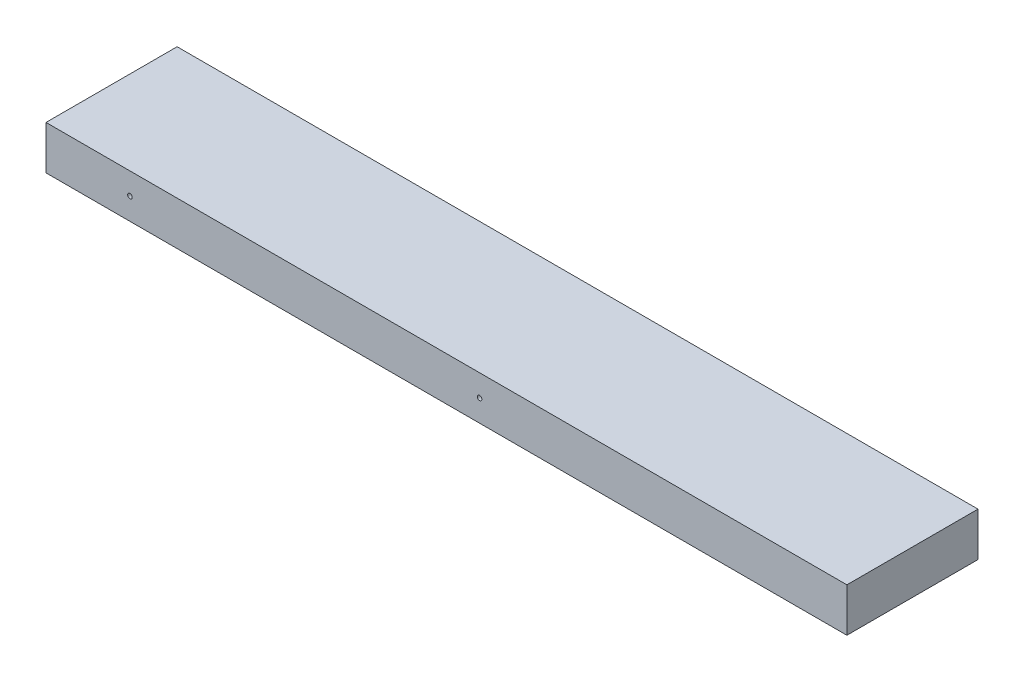
ISO-10303-21;
HEADER;
FILE_DESCRIPTION(('STEP AP214'),'2;1');
FILE_NAME('part.step','',(''),(''),'','','');
FILE_SCHEMA(('AUTOMOTIVE_DESIGN { 1 0 10303 214 1 1 1 1 }'));
ENDSEC;
DATA;
#1=APPLICATION_CONTEXT('core data for automotive mechanical design processes');
#2=APPLICATION_PROTOCOL_DEFINITION('international standard','automotive_design',2000,#1);
#3=PRODUCT_CONTEXT('',#1,'mechanical');
#4=PRODUCT('Part','Part','',(#3));
#5=PRODUCT_RELATED_PRODUCT_CATEGORY('part','',(#4));
#6=PRODUCT_DEFINITION_FORMATION('','',#4);
#7=PRODUCT_DEFINITION_CONTEXT('part definition',#1,'design');
#8=PRODUCT_DEFINITION('design','',#6,#7);
#9=PRODUCT_DEFINITION_SHAPE('','',#8);
#10=(LENGTH_UNIT() NAMED_UNIT(*) SI_UNIT(.MILLI.,.METRE.));
#11=(NAMED_UNIT(*) PLANE_ANGLE_UNIT() SI_UNIT($,.RADIAN.));
#12=(NAMED_UNIT(*) SI_UNIT($,.STERADIAN.) SOLID_ANGLE_UNIT());
#13=UNCERTAINTY_MEASURE_WITH_UNIT(LENGTH_MEASURE(1.E-05),#10,'distance_accuracy_value','');
#14=(GEOMETRIC_REPRESENTATION_CONTEXT(3) GLOBAL_UNCERTAINTY_ASSIGNED_CONTEXT((#13)) GLOBAL_UNIT_ASSIGNED_CONTEXT((#10,
#11,#12)) REPRESENTATION_CONTEXT('',''));
#15=CARTESIAN_POINT('',(0.,0.,0.));
#16=DIRECTION('',(0.,0.,1.));
#17=DIRECTION('',(1.,0.,0.));
#18=AXIS2_PLACEMENT_3D('',#15,#16,#17);
#19=CARTESIAN_POINT('',(86.360000000001,5213.35,2683.51));
#20=DIRECTION('',(0.,-1.,0.));
#21=DIRECTION('',(0.,0.,-1.));
#22=AXIS2_PLACEMENT_3D('',#19,#20,#21);
#23=PLANE('',#22);
#24=DIRECTION('',(0.,0.,-1.));
#25=VECTOR('',#24,1.);
#26=CARTESIAN_POINT('',(96.1779514960074,5213.35,2740.66));
#27=LINE('',#26,#25);
#28=CARTESIAN_POINT('',(96.1779514960074,5213.35,2740.66));
#29=VERTEX_POINT('',#28);
#30=CARTESIAN_POINT('',(96.1779514960074,5213.35,2683.51));
#31=VERTEX_POINT('',#30);
#32=EDGE_CURVE('E104',#29,#31,#27,.T.);
#33=ORIENTED_EDGE('',*,*,#32,.T.);
#34=DIRECTION('',(1.,0.,0.));
#35=VECTOR('',#34,1.);
#36=CARTESIAN_POINT('',(265.815570864873,5213.35,2683.51));
#37=LINE('',#36,#35);
#38=CARTESIAN_POINT('',(445.271141729744,5213.35000000001,2683.51));
#39=VERTEX_POINT('',#38);
#40=EDGE_CURVE('E158',#31,#39,#37,.T.);
#41=ORIENTED_EDGE('',*,*,#40,.T.);
#42=DIRECTION('',(0.,0.,-1.));
#43=VECTOR('',#42,1.);
#44=CARTESIAN_POINT('',(445.271141729744,5213.35000000001,2683.51));
#45=LINE('',#44,#43);
#46=CARTESIAN_POINT('',(445.271141729743,5213.35000000001,2740.66));
#47=VERTEX_POINT('',#46);
#48=EDGE_CURVE('E117',#47,#39,#45,.T.);
#49=ORIENTED_EDGE('',*,*,#48,.F.);
#50=DIRECTION('',(-1.,0.,0.));
#51=VECTOR('',#50,1.);
#52=CARTESIAN_POINT('',(265.815570864873,5213.35000000001,2740.66));
#53=LINE('',#52,#51);
#54=EDGE_CURVE('E80',#47,#29,#53,.T.);
#55=ORIENTED_EDGE('',*,*,#54,.T.);
#56=EDGE_LOOP('',(#33,#41,#49,#55));
#57=FACE_BOUND('',#56,.T.);
#58=ADVANCED_FACE('F40',(#57),#23,.T.);
#59=CARTESIAN_POINT('',(265.815570864873,5222.87500000001,2740.66));
#60=DIRECTION('',(0.,0.,-1.));
#61=DIRECTION('',(-1.,0.,0.));
#62=AXIS2_PLACEMENT_3D('',#59,#60,#61);
#63=PLANE('',#62);
#64=CARTESIAN_POINT('',(132.77322279899,5222.87500000001,2740.66));
#65=DIRECTION('',(0.,0.,-1.));
#66=DIRECTION('',(-1.,0.,0.));
#67=AXIS2_PLACEMENT_3D('',#64,#65,#66);
#68=CIRCLE('',#67,0.991870000000006);
#69=CARTESIAN_POINT('',(131.78135279899,5222.87500000001,2740.66));
#70=VERTEX_POINT('',#69);
#71=EDGE_CURVE('E43',#70,#70,#68,.T.);
#72=ORIENTED_EDGE('',*,*,#71,.T.);
#73=EDGE_LOOP('',(#72));
#74=FACE_BOUND('',#73,.T.);
#75=CARTESIAN_POINT('',(285.17322279899,5222.87500000001,2740.66));
#76=DIRECTION('',(0.,0.,-1.));
#77=DIRECTION('',(-1.,0.,0.));
#78=AXIS2_PLACEMENT_3D('',#75,#76,#77);
#79=CIRCLE('',#78,0.991870000000006);
#80=CARTESIAN_POINT('',(284.18135279899,5222.87500000001,2740.66));
#81=VERTEX_POINT('',#80);
#82=EDGE_CURVE('E135',#81,#81,#79,.T.);
#83=ORIENTED_EDGE('',*,*,#82,.T.);
#84=EDGE_LOOP('',(#83));
#85=FACE_BOUND('',#84,.T.);
#86=DIRECTION('',(1.,0.,0.));
#87=VECTOR('',#86,1.);
#88=CARTESIAN_POINT('',(445.271141729744,5232.4,2740.66));
#89=LINE('',#88,#87);
#90=CARTESIAN_POINT('',(96.177951496007,5232.40000000001,2740.66));
#91=VERTEX_POINT('',#90);
#92=CARTESIAN_POINT('',(445.271141729743,5232.40000000001,2740.66));
#93=VERTEX_POINT('',#92);
#94=EDGE_CURVE('E115',#91,#93,#89,.T.);
#95=ORIENTED_EDGE('',*,*,#94,.F.);
#96=DIRECTION('',(0.,-1.,0.));
#97=VECTOR('',#96,1.);
#98=CARTESIAN_POINT('',(96.1779514960074,5213.35,2740.66));
#99=LINE('',#98,#97);
#100=EDGE_CURVE('E56',#91,#29,#99,.T.);
#101=ORIENTED_EDGE('',*,*,#100,.T.);
#102=ORIENTED_EDGE('',*,*,#54,.F.);
#103=DIRECTION('',(0.,1.,0.));
#104=VECTOR('',#103,1.);
#105=CARTESIAN_POINT('',(445.271141729744,5213.35000000001,2740.66));
#106=LINE('',#105,#104);
#107=EDGE_CURVE('E119',#93,#47,#106,.F.);
#108=ORIENTED_EDGE('',*,*,#107,.F.);
#109=EDGE_LOOP('',(#95,#101,#102,#108));
#110=FACE_BOUND('',#109,.T.);
#111=ADVANCED_FACE('F114',(#74,#85,#110),#63,.F.);
#112=CARTESIAN_POINT('',(445.271141729744,5213.35000000001,2683.51));
#113=DIRECTION('',(1.,0.,0.));
#114=DIRECTION('',(0.,0.,-1.));
#115=AXIS2_PLACEMENT_3D('',#112,#113,#114);
#116=PLANE('',#115);
#117=DIRECTION('',(0.,1.,0.));
#118=VECTOR('',#117,1.);
#119=CARTESIAN_POINT('',(445.271141729743,5222.87500000001,2683.51));
#120=LINE('',#119,#118);
#121=CARTESIAN_POINT('',(445.271141729745,5232.40000000001,2683.51));
#122=VERTEX_POINT('',#121);
#123=EDGE_CURVE('E65',#39,#122,#120,.T.);
#124=ORIENTED_EDGE('',*,*,#123,.T.);
#125=DIRECTION('',(0.,0.,1.));
#126=VECTOR('',#125,1.);
#127=CARTESIAN_POINT('',(445.271141729745,5232.40000000001,2683.51));
#128=LINE('',#127,#126);
#129=EDGE_CURVE('E48',#93,#122,#128,.F.);
#130=ORIENTED_EDGE('',*,*,#129,.F.);
#131=ORIENTED_EDGE('',*,*,#107,.T.);
#132=ORIENTED_EDGE('',*,*,#48,.T.);
#133=EDGE_LOOP('',(#124,#130,#131,#132));
#134=FACE_BOUND('',#133,.T.);
#135=ADVANCED_FACE('F159',(#134),#116,.T.);
#136=CARTESIAN_POINT('',(265.815570864873,5222.87500000001,2683.51));
#137=DIRECTION('',(0.,0.,1.));
#138=DIRECTION('',(1.,0.,0.));
#139=AXIS2_PLACEMENT_3D('',#136,#137,#138);
#140=PLANE('',#139);
#141=CARTESIAN_POINT('',(412.173222798992,5222.875,2683.51));
#142=DIRECTION('',(0.,0.,1.));
#143=DIRECTION('',(1.,0.,0.));
#144=AXIS2_PLACEMENT_3D('',#141,#142,#143);
#145=CIRCLE('',#144,0.991870000000006);
#146=CARTESIAN_POINT('',(413.165092798992,5222.875,2683.51));
#147=VERTEX_POINT('',#146);
#148=EDGE_CURVE('E132',#147,#147,#145,.T.);
#149=ORIENTED_EDGE('',*,*,#148,.T.);
#150=EDGE_LOOP('',(#149));
#151=FACE_BOUND('',#150,.T.);
#152=CARTESIAN_POINT('',(310.573222798991,5222.87500000001,2683.51));
#153=DIRECTION('',(0.,0.,1.));
#154=DIRECTION('',(1.,0.,0.));
#155=AXIS2_PLACEMENT_3D('',#152,#153,#154);
#156=CIRCLE('',#155,0.991870000000006);
#157=CARTESIAN_POINT('',(311.565092798991,5222.87500000001,2683.51));
#158=VERTEX_POINT('',#157);
#159=EDGE_CURVE('E128',#158,#158,#156,.T.);
#160=ORIENTED_EDGE('',*,*,#159,.T.);
#161=EDGE_LOOP('',(#160));
#162=FACE_BOUND('',#161,.T.);
#163=CARTESIAN_POINT('',(107.373222798993,5222.875,2683.51));
#164=DIRECTION('',(0.,0.,1.));
#165=DIRECTION('',(1.,0.,0.));
#166=AXIS2_PLACEMENT_3D('',#163,#164,#165);
#167=CIRCLE('',#166,0.991870000000006);
#168=CARTESIAN_POINT('',(108.365092798993,5222.875,2683.51));
#169=VERTEX_POINT('',#168);
#170=EDGE_CURVE('E120',#169,#169,#167,.T.);
#171=ORIENTED_EDGE('',*,*,#170,.T.);
#172=EDGE_LOOP('',(#171));
#173=FACE_BOUND('',#172,.T.);
#174=ORIENTED_EDGE('',*,*,#40,.F.);
#175=DIRECTION('',(0.,-1.,0.));
#176=VECTOR('',#175,1.);
#177=CARTESIAN_POINT('',(96.1779514960074,5213.35,2683.51));
#178=LINE('',#177,#176);
#179=CARTESIAN_POINT('',(96.1779514960076,5232.40000000001,2683.51));
#180=VERTEX_POINT('',#179);
#181=EDGE_CURVE('E107',#180,#31,#178,.T.);
#182=ORIENTED_EDGE('',*,*,#181,.F.);
#183=DIRECTION('',(1.,0.,0.));
#184=VECTOR('',#183,1.);
#185=CARTESIAN_POINT('',(445.271141729745,5232.40000000001,2683.51));
#186=LINE('',#185,#184);
#187=EDGE_CURVE('E11',#122,#180,#186,.F.);
#188=ORIENTED_EDGE('',*,*,#187,.F.);
#189=ORIENTED_EDGE('',*,*,#123,.F.);
#190=EDGE_LOOP('',(#174,#182,#188,#189));
#191=FACE_BOUND('',#190,.T.);
#192=ADVANCED_FACE('F161',(#151,#162,#173,#191),#140,.F.);
#193=CARTESIAN_POINT('',(445.271141729745,5232.40000000001,2683.51));
#194=DIRECTION('',(0.,1.,0.));
#195=DIRECTION('',(0.,0.,1.));
#196=AXIS2_PLACEMENT_3D('',#193,#194,#195);
#197=PLANE('',#196);
#198=DIRECTION('',(0.,0.,-1.));
#199=VECTOR('',#198,1.);
#200=CARTESIAN_POINT('',(96.177951496007,5232.40000000001,2740.66));
#201=LINE('',#200,#199);
#202=EDGE_CURVE('E111',#91,#180,#201,.T.);
#203=ORIENTED_EDGE('',*,*,#202,.F.);
#204=ORIENTED_EDGE('',*,*,#94,.T.);
#205=ORIENTED_EDGE('',*,*,#129,.T.);
#206=ORIENTED_EDGE('',*,*,#187,.T.);
#207=EDGE_LOOP('',(#203,#204,#205,#206));
#208=FACE_BOUND('',#207,.T.);
#209=ADVANCED_FACE('F163',(#208),#197,.T.);
#210=CARTESIAN_POINT('',(107.373222798991,5222.87500000001,2664.46));
#211=DIRECTION('',(0.,0.,-1.));
#212=DIRECTION('',(-1.,0.,0.));
#213=AXIS2_PLACEMENT_3D('',#210,#211,#212);
#214=CYLINDRICAL_SURFACE('',#213,0.991870000000006);
#215=CARTESIAN_POINT('',(107.373222798991,5222.87500000001,2702.56));
#216=DIRECTION('',(0.,0.,-1.));
#217=DIRECTION('',(-1.,0.,0.));
#218=AXIS2_PLACEMENT_3D('',#215,#216,#217);
#219=CIRCLE('',#218,0.991870000000006);
#220=CARTESIAN_POINT('',(106.381352798991,5222.87500000001,2702.56));
#221=VERTEX_POINT('',#220);
#222=EDGE_CURVE('E124',#221,#221,#219,.T.);
#223=ORIENTED_EDGE('',*,*,#222,.F.);
#224=EDGE_LOOP('',(#223));
#225=FACE_BOUND('',#224,.T.);
#226=ORIENTED_EDGE('',*,*,#170,.F.);
#227=EDGE_LOOP('',(#226));
#228=FACE_BOUND('',#227,.T.);
#229=ADVANCED_FACE('F166',(#225,#228),#214,.F.);
#230=CARTESIAN_POINT('',(107.373222798991,5222.87500000001,2702.56));
#231=DIRECTION('',(0.,0.,-1.));
#232=DIRECTION('',(-1.,0.,0.));
#233=AXIS2_PLACEMENT_3D('',#230,#231,#232);
#234=CONICAL_SURFACE('',#233,0.991870000000006,1.02974425867677);
#235=CARTESIAN_POINT('',(107.373222798991,5222.87500000001,2703.1559756222));
#236=VERTEX_POINT('',#235);
#237=VERTEX_LOOP('',#236);
#238=FACE_BOUND('',#237,.T.);
#239=ORIENTED_EDGE('',*,*,#222,.T.);
#240=EDGE_LOOP('',(#239));
#241=FACE_BOUND('',#240,.T.);
#242=ADVANCED_FACE('F172',(#238,#241),#234,.F.);
#243=CARTESIAN_POINT('',(310.573222798993,5222.875,2664.46));
#244=DIRECTION('',(0.,0.,-1.));
#245=DIRECTION('',(-1.,0.,0.));
#246=AXIS2_PLACEMENT_3D('',#243,#244,#245);
#247=CYLINDRICAL_SURFACE('',#246,0.991870000000006);
#248=CARTESIAN_POINT('',(310.573222798991,5222.87500000001,2702.56));
#249=DIRECTION('',(0.,0.,-1.));
#250=DIRECTION('',(-1.,0.,0.));
#251=AXIS2_PLACEMENT_3D('',#248,#249,#250);
#252=CIRCLE('',#251,0.991870000000006);
#253=CARTESIAN_POINT('',(309.581352798991,5222.87500000001,2702.56));
#254=VERTEX_POINT('',#253);
#255=EDGE_CURVE('E131',#254,#254,#252,.T.);
#256=ORIENTED_EDGE('',*,*,#255,.F.);
#257=EDGE_LOOP('',(#256));
#258=FACE_BOUND('',#257,.T.);
#259=ORIENTED_EDGE('',*,*,#159,.F.);
#260=EDGE_LOOP('',(#259));
#261=FACE_BOUND('',#260,.T.);
#262=ADVANCED_FACE('F217',(#258,#261),#247,.F.);
#263=CARTESIAN_POINT('',(310.573222798991,5222.87500000001,2702.56));
#264=DIRECTION('',(0.,0.,-1.));
#265=DIRECTION('',(-1.,0.,0.));
#266=AXIS2_PLACEMENT_3D('',#263,#264,#265);
#267=CONICAL_SURFACE('',#266,0.991870000000006,1.02974425867677);
#268=CARTESIAN_POINT('',(310.57322279899,5222.87500000001,2703.1559756222));
#269=VERTEX_POINT('',#268);
#270=VERTEX_LOOP('',#269);
#271=FACE_BOUND('',#270,.T.);
#272=ORIENTED_EDGE('',*,*,#255,.T.);
#273=EDGE_LOOP('',(#272));
#274=FACE_BOUND('',#273,.T.);
#275=ADVANCED_FACE('F212',(#271,#274),#267,.F.);
#276=CARTESIAN_POINT('',(412.173222798991,5222.87500000001,2664.46));
#277=DIRECTION('',(0.,0.,-1.));
#278=DIRECTION('',(-1.,0.,0.));
#279=AXIS2_PLACEMENT_3D('',#276,#277,#278);
#280=CYLINDRICAL_SURFACE('',#279,0.991870000000006);
#281=CARTESIAN_POINT('',(412.173222798991,5222.87500000001,2702.56));
#282=DIRECTION('',(0.,0.,-1.));
#283=DIRECTION('',(-1.,0.,0.));
#284=AXIS2_PLACEMENT_3D('',#281,#282,#283);
#285=CIRCLE('',#284,0.991870000000006);
#286=CARTESIAN_POINT('',(411.181352798991,5222.87500000001,2702.56));
#287=VERTEX_POINT('',#286);
#288=EDGE_CURVE('E134',#287,#287,#285,.T.);
#289=ORIENTED_EDGE('',*,*,#288,.F.);
#290=EDGE_LOOP('',(#289));
#291=FACE_BOUND('',#290,.T.);
#292=ORIENTED_EDGE('',*,*,#148,.F.);
#293=EDGE_LOOP('',(#292));
#294=FACE_BOUND('',#293,.T.);
#295=ADVANCED_FACE('F209',(#291,#294),#280,.F.);
#296=CARTESIAN_POINT('',(412.173222798991,5222.87500000001,2702.56));
#297=DIRECTION('',(0.,0.,-1.));
#298=DIRECTION('',(-1.,0.,0.));
#299=AXIS2_PLACEMENT_3D('',#296,#297,#298);
#300=CONICAL_SURFACE('',#299,0.991870000000006,1.02974425867677);
#301=CARTESIAN_POINT('',(412.17322279899,5222.87500000001,2703.1559756222));
#302=VERTEX_POINT('',#301);
#303=VERTEX_LOOP('',#302);
#304=FACE_BOUND('',#303,.T.);
#305=ORIENTED_EDGE('',*,*,#288,.T.);
#306=EDGE_LOOP('',(#305));
#307=FACE_BOUND('',#306,.T.);
#308=ADVANCED_FACE('F206',(#304,#307),#300,.F.);
#309=CARTESIAN_POINT('',(285.173222798989,5222.87500000001,2759.71000000001));
#310=DIRECTION('',(0.,0.,1.));
#311=DIRECTION('',(1.,0.,0.));
#312=AXIS2_PLACEMENT_3D('',#309,#310,#311);
#313=CYLINDRICAL_SURFACE('',#312,0.991870000000006);
#314=CARTESIAN_POINT('',(285.17322279899,5222.87500000001,2721.61000000001));
#315=DIRECTION('',(0.,0.,1.));
#316=DIRECTION('',(1.,0.,0.));
#317=AXIS2_PLACEMENT_3D('',#314,#315,#316);
#318=CIRCLE('',#317,0.991870000000006);
#319=CARTESIAN_POINT('',(286.16509279899,5222.87500000001,2721.61000000001));
#320=VERTEX_POINT('',#319);
#321=EDGE_CURVE('E137',#320,#320,#318,.T.);
#322=ORIENTED_EDGE('',*,*,#321,.F.);
#323=EDGE_LOOP('',(#322));
#324=FACE_BOUND('',#323,.T.);
#325=ORIENTED_EDGE('',*,*,#82,.F.);
#326=EDGE_LOOP('',(#325));
#327=FACE_BOUND('',#326,.T.);
#328=ADVANCED_FACE('F199',(#324,#327),#313,.F.);
#329=CARTESIAN_POINT('',(285.17322279899,5222.87500000001,2721.61000000001));
#330=DIRECTION('',(0.,0.,1.));
#331=DIRECTION('',(1.,0.,0.));
#332=AXIS2_PLACEMENT_3D('',#329,#330,#331);
#333=CONICAL_SURFACE('',#332,0.991870000000006,1.02974425867677);
#334=CARTESIAN_POINT('',(285.17322279899,5222.87500000001,2721.01402437781));
#335=VERTEX_POINT('',#334);
#336=VERTEX_LOOP('',#335);
#337=FACE_BOUND('',#336,.T.);
#338=ORIENTED_EDGE('',*,*,#321,.T.);
#339=EDGE_LOOP('',(#338));
#340=FACE_BOUND('',#339,.T.);
#341=ADVANCED_FACE('F190',(#337,#340),#333,.F.);
#342=CARTESIAN_POINT('',(132.773222798991,5222.875,2759.71000000001));
#343=DIRECTION('',(0.,0.,1.));
#344=DIRECTION('',(1.,0.,0.));
#345=AXIS2_PLACEMENT_3D('',#342,#343,#344);
#346=CYLINDRICAL_SURFACE('',#345,0.991870000000006);
#347=CARTESIAN_POINT('',(132.77322279899,5222.87500000001,2721.61000000001));
#348=DIRECTION('',(0.,0.,1.));
#349=DIRECTION('',(1.,0.,0.));
#350=AXIS2_PLACEMENT_3D('',#347,#348,#349);
#351=CIRCLE('',#350,0.991870000000006);
#352=CARTESIAN_POINT('',(133.76509279899,5222.87500000001,2721.61000000001));
#353=VERTEX_POINT('',#352);
#354=EDGE_CURVE('E110',#353,#353,#351,.T.);
#355=ORIENTED_EDGE('',*,*,#354,.F.);
#356=EDGE_LOOP('',(#355));
#357=FACE_BOUND('',#356,.T.);
#358=ORIENTED_EDGE('',*,*,#71,.F.);
#359=EDGE_LOOP('',(#358));
#360=FACE_BOUND('',#359,.T.);
#361=ADVANCED_FACE('F187',(#357,#360),#346,.F.);
#362=CARTESIAN_POINT('',(132.77322279899,5222.87500000001,2721.61000000001));
#363=DIRECTION('',(0.,0.,1.));
#364=DIRECTION('',(1.,0.,0.));
#365=AXIS2_PLACEMENT_3D('',#362,#363,#364);
#366=CONICAL_SURFACE('',#365,0.991870000000006,1.02974425867677);
#367=CARTESIAN_POINT('',(132.773222798991,5222.87500000001,2721.01402437781));
#368=VERTEX_POINT('',#367);
#369=VERTEX_LOOP('',#368);
#370=FACE_BOUND('',#369,.T.);
#371=ORIENTED_EDGE('',*,*,#354,.T.);
#372=EDGE_LOOP('',(#371));
#373=FACE_BOUND('',#372,.T.);
#374=ADVANCED_FACE('F189',(#370,#373),#366,.F.);
#375=CARTESIAN_POINT('',(96.1779514960074,5213.35,2740.66));
#376=DIRECTION('',(1.,0.,0.));
#377=DIRECTION('',(0.,0.,-1.));
#378=AXIS2_PLACEMENT_3D('',#375,#376,#377);
#379=PLANE('',#378);
#380=ORIENTED_EDGE('',*,*,#181,.T.);
#381=ORIENTED_EDGE('',*,*,#32,.F.);
#382=ORIENTED_EDGE('',*,*,#100,.F.);
#383=ORIENTED_EDGE('',*,*,#202,.T.);
#384=EDGE_LOOP('',(#380,#381,#382,#383));
#385=FACE_BOUND('',#384,.T.);
#386=ADVANCED_FACE('F105',(#385),#379,.F.);
#387=CLOSED_SHELL('',(#58,#111,#135,#192,#209,#229,#242,#262,#275,#295,#308,#328,#341,#361,#374,#386));
#388=MANIFOLD_SOLID_BREP('B2',#387);
#389=ADVANCED_BREP_SHAPE_REPRESENTATION('',(#18,#388),#14);
#390=SHAPE_DEFINITION_REPRESENTATION(#9,#389);
ENDSEC;
END-ISO-10303-21;
